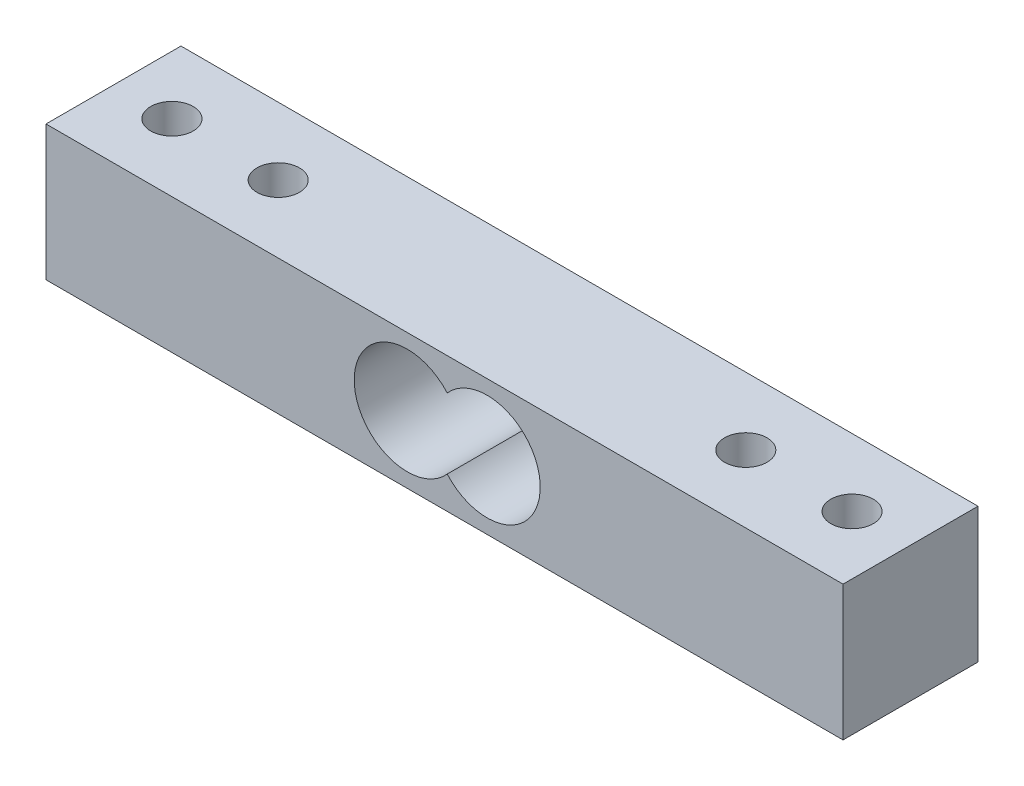
ISO-10303-21;
HEADER;
FILE_DESCRIPTION(('STEP AP214'),'2;1');
FILE_NAME('part.step','',(''),(''),'','','');
FILE_SCHEMA(('AUTOMOTIVE_DESIGN { 1 0 10303 214 1 1 1 1 }'));
ENDSEC;
DATA;
#1=APPLICATION_CONTEXT('core data for automotive mechanical design processes');
#2=APPLICATION_PROTOCOL_DEFINITION('international standard','automotive_design',2000,#1);
#3=PRODUCT_CONTEXT('',#1,'mechanical');
#4=PRODUCT('Part','Part','',(#3));
#5=PRODUCT_RELATED_PRODUCT_CATEGORY('part','',(#4));
#6=PRODUCT_DEFINITION_FORMATION('','',#4);
#7=PRODUCT_DEFINITION_CONTEXT('part definition',#1,'design');
#8=PRODUCT_DEFINITION('design','',#6,#7);
#9=PRODUCT_DEFINITION_SHAPE('','',#8);
#10=(LENGTH_UNIT() NAMED_UNIT(*) SI_UNIT(.MILLI.,.METRE.));
#11=(NAMED_UNIT(*) PLANE_ANGLE_UNIT() SI_UNIT($,.RADIAN.));
#12=(NAMED_UNIT(*) SI_UNIT($,.STERADIAN.) SOLID_ANGLE_UNIT());
#13=UNCERTAINTY_MEASURE_WITH_UNIT(LENGTH_MEASURE(1.E-05),#10,'distance_accuracy_value','');
#14=(GEOMETRIC_REPRESENTATION_CONTEXT(3) GLOBAL_UNCERTAINTY_ASSIGNED_CONTEXT((#13)) GLOBAL_UNIT_ASSIGNED_CONTEXT((#10,
#11,#12)) REPRESENTATION_CONTEXT('',''));
#15=CARTESIAN_POINT('',(0.,0.,0.));
#16=DIRECTION('',(0.,0.,1.));
#17=DIRECTION('',(1.,0.,0.));
#18=AXIS2_PLACEMENT_3D('',#15,#16,#17);
#19=CARTESIAN_POINT('',(0.,12.7,0.));
#20=DIRECTION('',(0.,1.,0.));
#21=DIRECTION('',(0.,0.,1.));
#22=AXIS2_PLACEMENT_3D('',#19,#20,#21);
#23=PLANE('',#22);
#24=CARTESIAN_POINT('',(22.,12.7,0.));
#25=DIRECTION('',(0.,1.,0.));
#26=DIRECTION('',(0.,0.,1.));
#27=AXIS2_PLACEMENT_3D('',#24,#25,#26);
#28=CIRCLE('',#27,2.);
#29=CARTESIAN_POINT('',(22.,12.7,2.));
#30=VERTEX_POINT('',#29);
#31=EDGE_CURVE('E123',#30,#30,#28,.T.);
#32=ORIENTED_EDGE('',*,*,#31,.F.);
#33=EDGE_LOOP('',(#32));
#34=FACE_BOUND('',#33,.T.);
#35=CARTESIAN_POINT('',(-32.,12.7,0.));
#36=DIRECTION('',(0.,1.,0.));
#37=DIRECTION('',(0.,0.,1.));
#38=AXIS2_PLACEMENT_3D('',#35,#36,#37);
#39=CIRCLE('',#38,2.);
#40=CARTESIAN_POINT('',(-32.,12.7,2.));
#41=VERTEX_POINT('',#40);
#42=EDGE_CURVE('E135',#41,#41,#39,.T.);
#43=ORIENTED_EDGE('',*,*,#42,.F.);
#44=EDGE_LOOP('',(#43));
#45=FACE_BOUND('',#44,.T.);
#46=DIRECTION('',(0.,0.,1.));
#47=VECTOR('',#46,1.);
#48=CARTESIAN_POINT('',(-37.5,12.7,6.35));
#49=LINE('',#48,#47);
#50=CARTESIAN_POINT('',(-37.5,12.7,-6.35));
#51=VERTEX_POINT('',#50);
#52=CARTESIAN_POINT('',(-37.5,12.7,6.35));
#53=VERTEX_POINT('',#52);
#54=EDGE_CURVE('E141',#51,#53,#49,.T.);
#55=ORIENTED_EDGE('',*,*,#54,.T.);
#56=DIRECTION('',(1.,0.,0.));
#57=VECTOR('',#56,1.);
#58=CARTESIAN_POINT('',(37.5,12.7,6.34999999999999));
#59=LINE('',#58,#57);
#60=CARTESIAN_POINT('',(37.5,12.7,6.34999999999999));
#61=VERTEX_POINT('',#60);
#62=EDGE_CURVE('E144',#53,#61,#59,.T.);
#63=ORIENTED_EDGE('',*,*,#62,.T.);
#64=DIRECTION('',(0.,0.,-1.));
#65=VECTOR('',#64,1.);
#66=CARTESIAN_POINT('',(37.5,12.7,6.34999999999999));
#67=LINE('',#66,#65);
#68=CARTESIAN_POINT('',(37.5,12.7,-6.35));
#69=VERTEX_POINT('',#68);
#70=EDGE_CURVE('E147',#61,#69,#67,.T.);
#71=ORIENTED_EDGE('',*,*,#70,.T.);
#72=DIRECTION('',(-1.,0.,0.));
#73=VECTOR('',#72,1.);
#74=CARTESIAN_POINT('',(37.5,12.7,-6.35));
#75=LINE('',#74,#73);
#76=EDGE_CURVE('E149',#69,#51,#75,.T.);
#77=ORIENTED_EDGE('',*,*,#76,.T.);
#78=EDGE_LOOP('',(#55,#63,#71,#77));
#79=FACE_BOUND('',#78,.T.);
#80=CARTESIAN_POINT('',(-22.,12.7,0.));
#81=DIRECTION('',(0.,1.,0.));
#82=DIRECTION('',(0.,0.,1.));
#83=AXIS2_PLACEMENT_3D('',#80,#81,#82);
#84=CIRCLE('',#83,2.);
#85=CARTESIAN_POINT('',(-22.,12.7,2.));
#86=VERTEX_POINT('',#85);
#87=EDGE_CURVE('E129',#86,#86,#84,.T.);
#88=ORIENTED_EDGE('',*,*,#87,.F.);
#89=EDGE_LOOP('',(#88));
#90=FACE_BOUND('',#89,.T.);
#91=CARTESIAN_POINT('',(32.,12.7,0.));
#92=DIRECTION('',(0.,1.,0.));
#93=DIRECTION('',(0.,0.,1.));
#94=AXIS2_PLACEMENT_3D('',#91,#92,#93);
#95=CIRCLE('',#94,2.);
#96=CARTESIAN_POINT('',(32.,12.7,2.));
#97=VERTEX_POINT('',#96);
#98=EDGE_CURVE('E117',#97,#97,#95,.T.);
#99=ORIENTED_EDGE('',*,*,#98,.F.);
#100=EDGE_LOOP('',(#99));
#101=FACE_BOUND('',#100,.T.);
#102=ADVANCED_FACE('F46',(#34,#45,#79,#90,#101),#23,.T.);
#103=CARTESIAN_POINT('',(0.,0.,0.));
#104=DIRECTION('',(0.,1.,0.));
#105=DIRECTION('',(0.,0.,1.));
#106=AXIS2_PLACEMENT_3D('',#103,#104,#105);
#107=PLANE('',#106);
#108=DIRECTION('',(0.,0.,1.));
#109=VECTOR('',#108,1.);
#110=CARTESIAN_POINT('',(-37.5,0.,6.35));
#111=LINE('',#110,#109);
#112=CARTESIAN_POINT('',(-37.5,0.,-6.35));
#113=VERTEX_POINT('',#112);
#114=CARTESIAN_POINT('',(-37.5,0.,6.35));
#115=VERTEX_POINT('',#114);
#116=EDGE_CURVE('E138',#113,#115,#111,.T.);
#117=ORIENTED_EDGE('',*,*,#116,.F.);
#118=DIRECTION('',(-1.,0.,0.));
#119=VECTOR('',#118,1.);
#120=CARTESIAN_POINT('',(37.5,0.,-6.35));
#121=LINE('',#120,#119);
#122=CARTESIAN_POINT('',(37.5,0.,-6.35));
#123=VERTEX_POINT('',#122);
#124=EDGE_CURVE('E145',#123,#113,#121,.T.);
#125=ORIENTED_EDGE('',*,*,#124,.F.);
#126=DIRECTION('',(0.,0.,-1.));
#127=VECTOR('',#126,1.);
#128=CARTESIAN_POINT('',(37.5,0.,6.34999999999999));
#129=LINE('',#128,#127);
#130=CARTESIAN_POINT('',(37.5,0.,6.34999999999999));
#131=VERTEX_POINT('',#130);
#132=EDGE_CURVE('E156',#131,#123,#129,.T.);
#133=ORIENTED_EDGE('',*,*,#132,.F.);
#134=DIRECTION('',(1.,0.,0.));
#135=VECTOR('',#134,1.);
#136=CARTESIAN_POINT('',(37.5,0.,6.34999999999999));
#137=LINE('',#136,#135);
#138=EDGE_CURVE('E154',#115,#131,#137,.T.);
#139=ORIENTED_EDGE('',*,*,#138,.F.);
#140=EDGE_LOOP('',(#117,#125,#133,#139));
#141=FACE_BOUND('',#140,.T.);
#142=CARTESIAN_POINT('',(-32.,0.,0.));
#143=DIRECTION('',(0.,1.,0.));
#144=DIRECTION('',(0.,0.,1.));
#145=AXIS2_PLACEMENT_3D('',#142,#143,#144);
#146=CIRCLE('',#145,2.);
#147=CARTESIAN_POINT('',(-32.,0.,2.));
#148=VERTEX_POINT('',#147);
#149=EDGE_CURVE('E132',#148,#148,#146,.T.);
#150=ORIENTED_EDGE('',*,*,#149,.T.);
#151=EDGE_LOOP('',(#150));
#152=FACE_BOUND('',#151,.T.);
#153=CARTESIAN_POINT('',(-22.,0.,0.));
#154=DIRECTION('',(0.,1.,0.));
#155=DIRECTION('',(0.,0.,1.));
#156=AXIS2_PLACEMENT_3D('',#153,#154,#155);
#157=CIRCLE('',#156,2.);
#158=CARTESIAN_POINT('',(-22.,0.,2.));
#159=VERTEX_POINT('',#158);
#160=EDGE_CURVE('E126',#159,#159,#157,.T.);
#161=ORIENTED_EDGE('',*,*,#160,.T.);
#162=EDGE_LOOP('',(#161));
#163=FACE_BOUND('',#162,.T.);
#164=CARTESIAN_POINT('',(22.,0.,0.));
#165=DIRECTION('',(0.,1.,0.));
#166=DIRECTION('',(0.,0.,1.));
#167=AXIS2_PLACEMENT_3D('',#164,#165,#166);
#168=CIRCLE('',#167,2.);
#169=CARTESIAN_POINT('',(22.,0.,2.));
#170=VERTEX_POINT('',#169);
#171=EDGE_CURVE('E120',#170,#170,#168,.T.);
#172=ORIENTED_EDGE('',*,*,#171,.T.);
#173=EDGE_LOOP('',(#172));
#174=FACE_BOUND('',#173,.T.);
#175=CARTESIAN_POINT('',(32.,0.,0.));
#176=DIRECTION('',(0.,1.,0.));
#177=DIRECTION('',(0.,0.,1.));
#178=AXIS2_PLACEMENT_3D('',#175,#176,#177);
#179=CIRCLE('',#178,2.);
#180=CARTESIAN_POINT('',(32.,0.,2.));
#181=VERTEX_POINT('',#180);
#182=EDGE_CURVE('E115',#181,#181,#179,.T.);
#183=ORIENTED_EDGE('',*,*,#182,.T.);
#184=EDGE_LOOP('',(#183));
#185=FACE_BOUND('',#184,.T.);
#186=ADVANCED_FACE('F174',(#141,#152,#163,#174,#185),#107,.F.);
#187=CARTESIAN_POINT('',(-37.5,12.7,6.35));
#188=DIRECTION('',(1.,0.,0.));
#189=DIRECTION('',(0.,0.,-1.));
#190=AXIS2_PLACEMENT_3D('',#187,#188,#189);
#191=PLANE('',#190);
#192=ORIENTED_EDGE('',*,*,#116,.T.);
#193=DIRECTION('',(0.,-1.,0.));
#194=VECTOR('',#193,1.);
#195=CARTESIAN_POINT('',(-37.5,12.7,6.35));
#196=LINE('',#195,#194);
#197=EDGE_CURVE('E12',#53,#115,#196,.T.);
#198=ORIENTED_EDGE('',*,*,#197,.F.);
#199=ORIENTED_EDGE('',*,*,#54,.F.);
#200=DIRECTION('',(0.,-1.,0.));
#201=VECTOR('',#200,1.);
#202=CARTESIAN_POINT('',(-37.5,12.7,-6.35));
#203=LINE('',#202,#201);
#204=EDGE_CURVE('E151',#51,#113,#203,.T.);
#205=ORIENTED_EDGE('',*,*,#204,.T.);
#206=EDGE_LOOP('',(#192,#198,#199,#205));
#207=FACE_BOUND('',#206,.T.);
#208=ADVANCED_FACE('F48',(#207),#191,.F.);
#209=CARTESIAN_POINT('',(37.5,12.7,6.34999999999999));
#210=DIRECTION('',(0.,0.,-1.));
#211=DIRECTION('',(-1.,0.,0.));
#212=AXIS2_PLACEMENT_3D('',#209,#210,#211);
#213=PLANE('',#212);
#214=CARTESIAN_POINT('',(4.00577117878977,6.35,6.35));
#215=DIRECTION('',(0.,0.,1.));
#216=DIRECTION('',(1.,0.,0.));
#217=AXIS2_PLACEMENT_3D('',#214,#215,#216);
#218=CIRCLE('',#217,5.);
#219=CARTESIAN_POINT('',(0.252885589394887,3.0460856922565,6.35));
#220=VERTEX_POINT('',#219);
#221=CARTESIAN_POINT('',(0.252885589394887,9.6539143077435,6.35));
#222=VERTEX_POINT('',#221);
#223=EDGE_CURVE('E110',#220,#222,#218,.T.);
#224=ORIENTED_EDGE('',*,*,#223,.F.);
#225=CARTESIAN_POINT('',(-3.5,6.35,6.35));
#226=DIRECTION('',(0.,0.,1.));
#227=DIRECTION('',(1.,0.,0.));
#228=AXIS2_PLACEMENT_3D('',#225,#226,#227);
#229=CIRCLE('',#228,5.);
#230=EDGE_CURVE('E61',#222,#220,#229,.T.);
#231=ORIENTED_EDGE('',*,*,#230,.F.);
#232=EDGE_LOOP('',(#224,#231));
#233=FACE_BOUND('',#232,.T.);
#234=ORIENTED_EDGE('',*,*,#138,.T.);
#235=DIRECTION('',(0.,-1.,0.));
#236=VECTOR('',#235,1.);
#237=CARTESIAN_POINT('',(37.5,12.7,6.34999999999999));
#238=LINE('',#237,#236);
#239=EDGE_CURVE('E54',#61,#131,#238,.T.);
#240=ORIENTED_EDGE('',*,*,#239,.F.);
#241=ORIENTED_EDGE('',*,*,#62,.F.);
#242=ORIENTED_EDGE('',*,*,#197,.T.);
#243=EDGE_LOOP('',(#234,#240,#241,#242));
#244=FACE_BOUND('',#243,.T.);
#245=ADVANCED_FACE('F183',(#233,#244),#213,.F.);
#246=CARTESIAN_POINT('',(37.5,12.7,6.34999999999999));
#247=DIRECTION('',(-1.,0.,0.));
#248=DIRECTION('',(0.,0.,1.));
#249=AXIS2_PLACEMENT_3D('',#246,#247,#248);
#250=PLANE('',#249);
#251=ORIENTED_EDGE('',*,*,#132,.T.);
#252=DIRECTION('',(0.,-1.,0.));
#253=VECTOR('',#252,1.);
#254=CARTESIAN_POINT('',(37.5,12.7,-6.35));
#255=LINE('',#254,#253);
#256=EDGE_CURVE('E161',#69,#123,#255,.T.);
#257=ORIENTED_EDGE('',*,*,#256,.F.);
#258=ORIENTED_EDGE('',*,*,#70,.F.);
#259=ORIENTED_EDGE('',*,*,#239,.T.);
#260=EDGE_LOOP('',(#251,#257,#258,#259));
#261=FACE_BOUND('',#260,.T.);
#262=ADVANCED_FACE('F168',(#261),#250,.F.);
#263=CARTESIAN_POINT('',(37.5,12.7,-6.35));
#264=DIRECTION('',(0.,0.,1.));
#265=DIRECTION('',(1.,0.,0.));
#266=AXIS2_PLACEMENT_3D('',#263,#264,#265);
#267=PLANE('',#266);
#268=CARTESIAN_POINT('',(4.00577117878977,6.35,-6.35));
#269=DIRECTION('',(0.,0.,1.));
#270=DIRECTION('',(1.,0.,0.));
#271=AXIS2_PLACEMENT_3D('',#268,#269,#270);
#272=CIRCLE('',#271,5.);
#273=CARTESIAN_POINT('',(0.252885589394887,3.0460856922565,-6.35));
#274=VERTEX_POINT('',#273);
#275=CARTESIAN_POINT('',(0.252885589394887,9.6539143077435,-6.35));
#276=VERTEX_POINT('',#275);
#277=EDGE_CURVE('E102',#274,#276,#272,.T.);
#278=ORIENTED_EDGE('',*,*,#277,.T.);
#279=CARTESIAN_POINT('',(-3.5,6.35,-6.35));
#280=DIRECTION('',(0.,0.,1.));
#281=DIRECTION('',(1.,0.,0.));
#282=AXIS2_PLACEMENT_3D('',#279,#280,#281);
#283=CIRCLE('',#282,5.);
#284=EDGE_CURVE('E66',#276,#274,#283,.T.);
#285=ORIENTED_EDGE('',*,*,#284,.T.);
#286=EDGE_LOOP('',(#278,#285));
#287=FACE_BOUND('',#286,.T.);
#288=ORIENTED_EDGE('',*,*,#124,.T.);
#289=ORIENTED_EDGE('',*,*,#204,.F.);
#290=ORIENTED_EDGE('',*,*,#76,.F.);
#291=ORIENTED_EDGE('',*,*,#256,.T.);
#292=EDGE_LOOP('',(#288,#289,#290,#291));
#293=FACE_BOUND('',#292,.T.);
#294=ADVANCED_FACE('F108',(#287,#293),#267,.F.);
#295=CARTESIAN_POINT('',(-32.,12.7,0.));
#296=DIRECTION('',(0.,-1.,0.));
#297=DIRECTION('',(0.,0.,-1.));
#298=AXIS2_PLACEMENT_3D('',#295,#296,#297);
#299=CYLINDRICAL_SURFACE('',#298,2.);
#300=ORIENTED_EDGE('',*,*,#42,.T.);
#301=EDGE_LOOP('',(#300));
#302=FACE_BOUND('',#301,.T.);
#303=ORIENTED_EDGE('',*,*,#149,.F.);
#304=EDGE_LOOP('',(#303));
#305=FACE_BOUND('',#304,.T.);
#306=ADVANCED_FACE('F201',(#302,#305),#299,.F.);
#307=CARTESIAN_POINT('',(-22.,12.7,0.));
#308=DIRECTION('',(0.,-1.,0.));
#309=DIRECTION('',(0.,0.,-1.));
#310=AXIS2_PLACEMENT_3D('',#307,#308,#309);
#311=CYLINDRICAL_SURFACE('',#310,2.);
#312=ORIENTED_EDGE('',*,*,#87,.T.);
#313=EDGE_LOOP('',(#312));
#314=FACE_BOUND('',#313,.T.);
#315=ORIENTED_EDGE('',*,*,#160,.F.);
#316=EDGE_LOOP('',(#315));
#317=FACE_BOUND('',#316,.T.);
#318=ADVANCED_FACE('F208',(#314,#317),#311,.F.);
#319=CARTESIAN_POINT('',(22.,12.7,0.));
#320=DIRECTION('',(0.,-1.,0.));
#321=DIRECTION('',(0.,0.,-1.));
#322=AXIS2_PLACEMENT_3D('',#319,#320,#321);
#323=CYLINDRICAL_SURFACE('',#322,2.);
#324=ORIENTED_EDGE('',*,*,#31,.T.);
#325=EDGE_LOOP('',(#324));
#326=FACE_BOUND('',#325,.T.);
#327=ORIENTED_EDGE('',*,*,#171,.F.);
#328=EDGE_LOOP('',(#327));
#329=FACE_BOUND('',#328,.T.);
#330=ADVANCED_FACE('F213',(#326,#329),#323,.F.);
#331=CARTESIAN_POINT('',(32.,12.7,0.));
#332=DIRECTION('',(0.,-1.,0.));
#333=DIRECTION('',(0.,0.,-1.));
#334=AXIS2_PLACEMENT_3D('',#331,#332,#333);
#335=CYLINDRICAL_SURFACE('',#334,2.);
#336=ORIENTED_EDGE('',*,*,#98,.T.);
#337=EDGE_LOOP('',(#336));
#338=FACE_BOUND('',#337,.T.);
#339=ORIENTED_EDGE('',*,*,#182,.F.);
#340=EDGE_LOOP('',(#339));
#341=FACE_BOUND('',#340,.T.);
#342=ADVANCED_FACE('F225',(#338,#341),#335,.F.);
#343=CARTESIAN_POINT('',(-3.5,6.35,-6.35));
#344=DIRECTION('',(0.,0.,1.));
#345=DIRECTION('',(1.,0.,0.));
#346=AXIS2_PLACEMENT_3D('',#343,#344,#345);
#347=CYLINDRICAL_SURFACE('',#346,5.);
#348=ORIENTED_EDGE('',*,*,#230,.T.);
#349=DIRECTION('',(0.,0.,1.));
#350=VECTOR('',#349,1.);
#351=CARTESIAN_POINT('',(0.252885589394887,3.0460856922565,-6.35));
#352=LINE('',#351,#350);
#353=EDGE_CURVE('E95',#274,#220,#352,.T.);
#354=ORIENTED_EDGE('',*,*,#353,.F.);
#355=ORIENTED_EDGE('',*,*,#284,.F.);
#356=DIRECTION('',(0.,0.,1.));
#357=VECTOR('',#356,1.);
#358=CARTESIAN_POINT('',(0.252885589394887,9.6539143077435,-6.35));
#359=LINE('',#358,#357);
#360=EDGE_CURVE('E101',#276,#222,#359,.T.);
#361=ORIENTED_EDGE('',*,*,#360,.T.);
#362=EDGE_LOOP('',(#348,#354,#355,#361));
#363=FACE_BOUND('',#362,.T.);
#364=ADVANCED_FACE('F97',(#363),#347,.F.);
#365=CARTESIAN_POINT('',(4.00577117878977,6.35,-6.35));
#366=DIRECTION('',(0.,0.,1.));
#367=DIRECTION('',(1.,0.,0.));
#368=AXIS2_PLACEMENT_3D('',#365,#366,#367);
#369=CYLINDRICAL_SURFACE('',#368,5.);
#370=ORIENTED_EDGE('',*,*,#223,.T.);
#371=ORIENTED_EDGE('',*,*,#360,.F.);
#372=ORIENTED_EDGE('',*,*,#277,.F.);
#373=ORIENTED_EDGE('',*,*,#353,.T.);
#374=EDGE_LOOP('',(#370,#371,#372,#373));
#375=FACE_BOUND('',#374,.T.);
#376=ADVANCED_FACE('F105',(#375),#369,.F.);
#377=CLOSED_SHELL('',(#102,#186,#208,#245,#262,#294,#306,#318,#330,#342,#364,#376));
#378=MANIFOLD_SOLID_BREP('B2',#377);
#379=ADVANCED_BREP_SHAPE_REPRESENTATION('',(#18,#378),#14);
#380=SHAPE_DEFINITION_REPRESENTATION(#9,#379);
ENDSEC;
END-ISO-10303-21;
